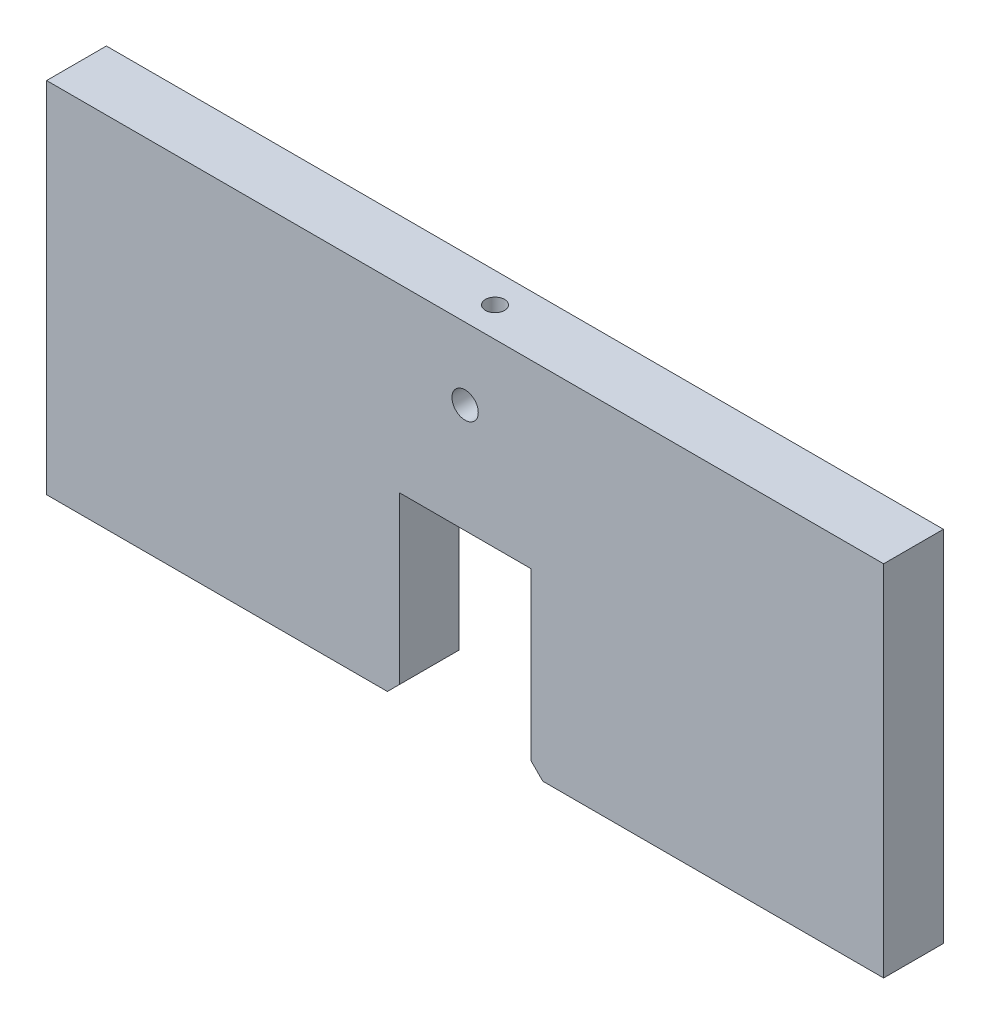
ISO-10303-21;
HEADER;
FILE_DESCRIPTION(('STEP AP214'),'2;1');
FILE_NAME('part.step','',(''),(''),'','','');
FILE_SCHEMA(('AUTOMOTIVE_DESIGN { 1 0 10303 214 1 1 1 1 }'));
ENDSEC;
DATA;
#1=APPLICATION_CONTEXT('core data for automotive mechanical design processes');
#2=APPLICATION_PROTOCOL_DEFINITION('international standard','automotive_design',2000,#1);
#3=PRODUCT_CONTEXT('',#1,'mechanical');
#4=PRODUCT('Part','Part','',(#3));
#5=PRODUCT_RELATED_PRODUCT_CATEGORY('part','',(#4));
#6=PRODUCT_DEFINITION_FORMATION('','',#4);
#7=PRODUCT_DEFINITION_CONTEXT('part definition',#1,'design');
#8=PRODUCT_DEFINITION('design','',#6,#7);
#9=PRODUCT_DEFINITION_SHAPE('','',#8);
#10=(LENGTH_UNIT() NAMED_UNIT(*) SI_UNIT(.MILLI.,.METRE.));
#11=(NAMED_UNIT(*) PLANE_ANGLE_UNIT() SI_UNIT($,.RADIAN.));
#12=(NAMED_UNIT(*) SI_UNIT($,.STERADIAN.) SOLID_ANGLE_UNIT());
#13=UNCERTAINTY_MEASURE_WITH_UNIT(LENGTH_MEASURE(1.E-05),#10,'distance_accuracy_value','');
#14=(GEOMETRIC_REPRESENTATION_CONTEXT(3) GLOBAL_UNCERTAINTY_ASSIGNED_CONTEXT((#13)) GLOBAL_UNIT_ASSIGNED_CONTEXT((#10,
#11,#12)) REPRESENTATION_CONTEXT('',''));
#15=CARTESIAN_POINT('',(0.,0.,0.));
#16=DIRECTION('',(0.,0.,1.));
#17=DIRECTION('',(1.,0.,0.));
#18=AXIS2_PLACEMENT_3D('',#15,#16,#17);
#19=CARTESIAN_POINT('',(-350.,232.421392473446,25.));
#20=DIRECTION('',(1.,0.,0.));
#21=DIRECTION('',(0.,1.,0.));
#22=AXIS2_PLACEMENT_3D('',#19,#20,#21);
#23=PLANE('',#22);
#24=DIRECTION('',(0.,-1.,0.));
#25=VECTOR('',#24,1.);
#26=CARTESIAN_POINT('',(-350.,232.421392473446,-25.));
#27=LINE('',#26,#25);
#28=CARTESIAN_POINT('',(-350.,232.421392473446,-25.));
#29=VERTEX_POINT('',#28);
#30=CARTESIAN_POINT('',(-350.,-67.5786075265541,-25.));
#31=VERTEX_POINT('',#30);
#32=EDGE_CURVE('E140',#29,#31,#27,.T.);
#33=ORIENTED_EDGE('',*,*,#32,.T.);
#34=DIRECTION('',(0.,0.,-1.));
#35=VECTOR('',#34,1.);
#36=CARTESIAN_POINT('',(-350.,-67.5786075265541,25.));
#37=LINE('',#36,#35);
#38=CARTESIAN_POINT('',(-350.,-67.5786075265541,25.));
#39=VERTEX_POINT('',#38);
#40=EDGE_CURVE('E11',#39,#31,#37,.T.);
#41=ORIENTED_EDGE('',*,*,#40,.F.);
#42=DIRECTION('',(0.,-1.,0.));
#43=VECTOR('',#42,1.);
#44=CARTESIAN_POINT('',(-350.,232.421392473446,25.));
#45=LINE('',#44,#43);
#46=CARTESIAN_POINT('',(-350.,232.421392473446,25.));
#47=VERTEX_POINT('',#46);
#48=EDGE_CURVE('E159',#47,#39,#45,.T.);
#49=ORIENTED_EDGE('',*,*,#48,.F.);
#50=DIRECTION('',(0.,0.,-1.));
#51=VECTOR('',#50,1.);
#52=CARTESIAN_POINT('',(-350.,232.421392473446,25.));
#53=LINE('',#52,#51);
#54=EDGE_CURVE('E136',#47,#29,#53,.T.);
#55=ORIENTED_EDGE('',*,*,#54,.T.);
#56=EDGE_LOOP('',(#33,#41,#49,#55));
#57=FACE_BOUND('',#56,.T.);
#58=ADVANCED_FACE('F32',(#57),#23,.F.);
#59=CARTESIAN_POINT('',(-350.,-67.5786075265541,25.));
#60=DIRECTION('',(0.,1.,0.));
#61=DIRECTION('',(-1.,0.,0.));
#62=AXIS2_PLACEMENT_3D('',#59,#60,#61);
#63=PLANE('',#62);
#64=CARTESIAN_POINT('',(-80.,-67.5786075265541,0.));
#65=DIRECTION('',(0.,-1.,0.));
#66=DIRECTION('',(1.,0.,0.));
#67=AXIS2_PLACEMENT_3D('',#64,#65,#66);
#68=CIRCLE('',#67,8.);
#69=CARTESIAN_POINT('',(-72.,-67.5786075265541,0.));
#70=VERTEX_POINT('',#69);
#71=EDGE_CURVE('E218',#70,#70,#68,.T.);
#72=ORIENTED_EDGE('',*,*,#71,.F.);
#73=EDGE_LOOP('',(#72));
#74=FACE_BOUND('',#73,.T.);
#75=DIRECTION('',(1.,0.,0.));
#76=VECTOR('',#75,1.);
#77=CARTESIAN_POINT('',(-350.,-67.5786075265541,-25.));
#78=LINE('',#77,#76);
#79=CARTESIAN_POINT('',(-65.,-67.5786075265541,-25.));
#80=VERTEX_POINT('',#79);
#81=EDGE_CURVE('E143',#31,#80,#78,.T.);
#82=ORIENTED_EDGE('',*,*,#81,.T.);
#83=DIRECTION('',(0.,0.,-1.));
#84=VECTOR('',#83,1.);
#85=CARTESIAN_POINT('',(-65.,-67.5786075265541,25.));
#86=LINE('',#85,#84);
#87=CARTESIAN_POINT('',(-65.,-67.5786075265541,25.));
#88=VERTEX_POINT('',#87);
#89=EDGE_CURVE('E40',#88,#80,#86,.T.);
#90=ORIENTED_EDGE('',*,*,#89,.F.);
#91=DIRECTION('',(1.,0.,0.));
#92=VECTOR('',#91,1.);
#93=CARTESIAN_POINT('',(-350.,-67.5786075265541,25.));
#94=LINE('',#93,#92);
#95=EDGE_CURVE('E97',#39,#88,#94,.T.);
#96=ORIENTED_EDGE('',*,*,#95,.F.);
#97=ORIENTED_EDGE('',*,*,#40,.T.);
#98=EDGE_LOOP('',(#82,#90,#96,#97));
#99=FACE_BOUND('',#98,.T.);
#100=ADVANCED_FACE('F252',(#74,#99),#63,.F.);
#101=CARTESIAN_POINT('',(-65.,-67.5786075265541,25.));
#102=DIRECTION('',(-0.707106781186546,0.707106781186549,0.));
#103=DIRECTION('',(-0.707106781186549,-0.707106781186546,0.));
#104=AXIS2_PLACEMENT_3D('',#101,#102,#103);
#105=PLANE('',#104);
#106=DIRECTION('',(0.707106781186549,0.707106781186546,0.));
#107=VECTOR('',#106,1.);
#108=CARTESIAN_POINT('',(-65.,-67.5786075265541,-25.));
#109=LINE('',#108,#107);
#110=CARTESIAN_POINT('',(-55.,-57.5786075265541,-25.));
#111=VERTEX_POINT('',#110);
#112=EDGE_CURVE('E146',#80,#111,#109,.T.);
#113=ORIENTED_EDGE('',*,*,#112,.T.);
#114=DIRECTION('',(0.,0.,-1.));
#115=VECTOR('',#114,1.);
#116=CARTESIAN_POINT('',(-55.,-57.5786075265541,25.));
#117=LINE('',#116,#115);
#118=CARTESIAN_POINT('',(-55.,-57.5786075265541,25.));
#119=VERTEX_POINT('',#118);
#120=EDGE_CURVE('E172',#119,#111,#117,.T.);
#121=ORIENTED_EDGE('',*,*,#120,.F.);
#122=DIRECTION('',(0.707106781186549,0.707106781186546,0.));
#123=VECTOR('',#122,1.);
#124=CARTESIAN_POINT('',(-65.,-67.5786075265541,25.));
#125=LINE('',#124,#123);
#126=EDGE_CURVE('E180',#88,#119,#125,.T.);
#127=ORIENTED_EDGE('',*,*,#126,.F.);
#128=ORIENTED_EDGE('',*,*,#89,.T.);
#129=EDGE_LOOP('',(#113,#121,#127,#128));
#130=FACE_BOUND('',#129,.T.);
#131=ADVANCED_FACE('F178',(#130),#105,.F.);
#132=CARTESIAN_POINT('',(-55.,-57.5786075265541,25.));
#133=DIRECTION('',(-1.,0.,0.));
#134=DIRECTION('',(0.,0.,1.));
#135=AXIS2_PLACEMENT_3D('',#132,#133,#134);
#136=PLANE('',#135);
#137=DIRECTION('',(0.,1.,0.));
#138=VECTOR('',#137,1.);
#139=CARTESIAN_POINT('',(-55.,-57.5786075265541,-25.));
#140=LINE('',#139,#138);
#141=CARTESIAN_POINT('',(-55.,81.4213924734459,-25.));
#142=VERTEX_POINT('',#141);
#143=EDGE_CURVE('E148',#111,#142,#140,.T.);
#144=ORIENTED_EDGE('',*,*,#143,.T.);
#145=DIRECTION('',(0.,0.,-1.));
#146=VECTOR('',#145,1.);
#147=CARTESIAN_POINT('',(-55.,81.4213924734459,25.));
#148=LINE('',#147,#146);
#149=CARTESIAN_POINT('',(-55.,81.4213924734459,25.));
#150=VERTEX_POINT('',#149);
#151=EDGE_CURVE('E169',#150,#142,#148,.T.);
#152=ORIENTED_EDGE('',*,*,#151,.F.);
#153=DIRECTION('',(0.,1.,0.));
#154=VECTOR('',#153,1.);
#155=CARTESIAN_POINT('',(-55.,-57.5786075265541,25.));
#156=LINE('',#155,#154);
#157=EDGE_CURVE('E198',#119,#150,#156,.T.);
#158=ORIENTED_EDGE('',*,*,#157,.F.);
#159=ORIENTED_EDGE('',*,*,#120,.T.);
#160=EDGE_LOOP('',(#144,#152,#158,#159));
#161=FACE_BOUND('',#160,.T.);
#162=ADVANCED_FACE('F189',(#161),#136,.F.);
#163=CARTESIAN_POINT('',(-55.,81.4213924734459,25.));
#164=DIRECTION('',(0.,1.,0.));
#165=DIRECTION('',(0.,0.,1.));
#166=AXIS2_PLACEMENT_3D('',#163,#164,#165);
#167=PLANE('',#166);
#168=DIRECTION('',(1.,0.,0.));
#169=VECTOR('',#168,1.);
#170=CARTESIAN_POINT('',(-55.,81.4213924734459,-25.));
#171=LINE('',#170,#169);
#172=CARTESIAN_POINT('',(55.,81.4213924734459,-25.));
#173=VERTEX_POINT('',#172);
#174=EDGE_CURVE('E150',#142,#173,#171,.T.);
#175=ORIENTED_EDGE('',*,*,#174,.T.);
#176=DIRECTION('',(0.,0.,-1.));
#177=VECTOR('',#176,1.);
#178=CARTESIAN_POINT('',(55.,81.4213924734459,25.));
#179=LINE('',#178,#177);
#180=CARTESIAN_POINT('',(55.,81.4213924734459,25.));
#181=VERTEX_POINT('',#180);
#182=EDGE_CURVE('E166',#181,#173,#179,.T.);
#183=ORIENTED_EDGE('',*,*,#182,.F.);
#184=DIRECTION('',(1.,0.,0.));
#185=VECTOR('',#184,1.);
#186=CARTESIAN_POINT('',(-55.,81.4213924734459,25.));
#187=LINE('',#186,#185);
#188=EDGE_CURVE('E195',#150,#181,#187,.T.);
#189=ORIENTED_EDGE('',*,*,#188,.F.);
#190=ORIENTED_EDGE('',*,*,#151,.T.);
#191=EDGE_LOOP('',(#175,#183,#189,#190));
#192=FACE_BOUND('',#191,.T.);
#193=ADVANCED_FACE('F193',(#192),#167,.F.);
#194=CARTESIAN_POINT('',(55.,-57.5786075265541,25.));
#195=DIRECTION('',(1.,0.,0.));
#196=DIRECTION('',(0.,1.,0.));
#197=AXIS2_PLACEMENT_3D('',#194,#195,#196);
#198=PLANE('',#197);
#199=DIRECTION('',(0.,-1.,0.));
#200=VECTOR('',#199,1.);
#201=CARTESIAN_POINT('',(55.,-57.5786075265541,-25.));
#202=LINE('',#201,#200);
#203=CARTESIAN_POINT('',(55.,-57.5786075265541,-25.));
#204=VERTEX_POINT('',#203);
#205=EDGE_CURVE('E152',#173,#204,#202,.T.);
#206=ORIENTED_EDGE('',*,*,#205,.T.);
#207=DIRECTION('',(0.,0.,-1.));
#208=VECTOR('',#207,1.);
#209=CARTESIAN_POINT('',(55.,-57.5786075265541,25.));
#210=LINE('',#209,#208);
#211=CARTESIAN_POINT('',(55.,-57.5786075265541,25.));
#212=VERTEX_POINT('',#211);
#213=EDGE_CURVE('E163',#212,#204,#210,.T.);
#214=ORIENTED_EDGE('',*,*,#213,.F.);
#215=DIRECTION('',(0.,-1.,0.));
#216=VECTOR('',#215,1.);
#217=CARTESIAN_POINT('',(55.,-57.5786075265541,25.));
#218=LINE('',#217,#216);
#219=EDGE_CURVE('E197',#181,#212,#218,.T.);
#220=ORIENTED_EDGE('',*,*,#219,.F.);
#221=ORIENTED_EDGE('',*,*,#182,.T.);
#222=EDGE_LOOP('',(#206,#214,#220,#221));
#223=FACE_BOUND('',#222,.T.);
#224=ADVANCED_FACE('F248',(#223),#198,.F.);
#225=CARTESIAN_POINT('',(65.,-67.5786075265541,25.));
#226=DIRECTION('',(0.707106781186546,0.707106781186549,0.));
#227=DIRECTION('',(-0.707106781186549,0.707106781186546,0.));
#228=AXIS2_PLACEMENT_3D('',#225,#226,#227);
#229=PLANE('',#228);
#230=DIRECTION('',(0.707106781186549,-0.707106781186546,0.));
#231=VECTOR('',#230,1.);
#232=CARTESIAN_POINT('',(65.,-67.5786075265541,-25.));
#233=LINE('',#232,#231);
#234=CARTESIAN_POINT('',(65.,-67.5786075265541,-25.));
#235=VERTEX_POINT('',#234);
#236=EDGE_CURVE('E154',#204,#235,#233,.T.);
#237=ORIENTED_EDGE('',*,*,#236,.T.);
#238=DIRECTION('',(0.,0.,-1.));
#239=VECTOR('',#238,1.);
#240=CARTESIAN_POINT('',(65.,-67.5786075265541,25.));
#241=LINE('',#240,#239);
#242=CARTESIAN_POINT('',(65.,-67.5786075265541,25.));
#243=VERTEX_POINT('',#242);
#244=EDGE_CURVE('E131',#243,#235,#241,.T.);
#245=ORIENTED_EDGE('',*,*,#244,.F.);
#246=DIRECTION('',(0.707106781186549,-0.707106781186546,0.));
#247=VECTOR('',#246,1.);
#248=CARTESIAN_POINT('',(65.,-67.5786075265541,25.));
#249=LINE('',#248,#247);
#250=EDGE_CURVE('E122',#212,#243,#249,.T.);
#251=ORIENTED_EDGE('',*,*,#250,.F.);
#252=ORIENTED_EDGE('',*,*,#213,.T.);
#253=EDGE_LOOP('',(#237,#245,#251,#252));
#254=FACE_BOUND('',#253,.T.);
#255=ADVANCED_FACE('F240',(#254),#229,.F.);
#256=CARTESIAN_POINT('',(350.,-67.5786075265541,25.));
#257=DIRECTION('',(0.,1.,0.));
#258=DIRECTION('',(0.,0.,1.));
#259=AXIS2_PLACEMENT_3D('',#256,#257,#258);
#260=PLANE('',#259);
#261=CARTESIAN_POINT('',(80.,-67.578607526554,0.));
#262=DIRECTION('',(0.,-1.,0.));
#263=DIRECTION('',(1.,0.,0.));
#264=AXIS2_PLACEMENT_3D('',#261,#262,#263);
#265=CIRCLE('',#264,8.);
#266=CARTESIAN_POINT('',(88.,-67.578607526554,0.));
#267=VERTEX_POINT('',#266);
#268=EDGE_CURVE('E224',#267,#267,#265,.T.);
#269=ORIENTED_EDGE('',*,*,#268,.F.);
#270=EDGE_LOOP('',(#269));
#271=FACE_BOUND('',#270,.T.);
#272=DIRECTION('',(1.,0.,0.));
#273=VECTOR('',#272,1.);
#274=CARTESIAN_POINT('',(350.,-67.5786075265541,-25.));
#275=LINE('',#274,#273);
#276=CARTESIAN_POINT('',(350.,-67.5786075265541,-25.));
#277=VERTEX_POINT('',#276);
#278=EDGE_CURVE('E130',#235,#277,#275,.T.);
#279=ORIENTED_EDGE('',*,*,#278,.T.);
#280=DIRECTION('',(0.,0.,-1.));
#281=VECTOR('',#280,1.);
#282=CARTESIAN_POINT('',(350.,-67.5786075265541,25.));
#283=LINE('',#282,#281);
#284=CARTESIAN_POINT('',(350.,-67.5786075265541,25.));
#285=VERTEX_POINT('',#284);
#286=EDGE_CURVE('E127',#285,#277,#283,.T.);
#287=ORIENTED_EDGE('',*,*,#286,.F.);
#288=DIRECTION('',(1.,0.,0.));
#289=VECTOR('',#288,1.);
#290=CARTESIAN_POINT('',(350.,-67.5786075265541,25.));
#291=LINE('',#290,#289);
#292=EDGE_CURVE('E116',#243,#285,#291,.T.);
#293=ORIENTED_EDGE('',*,*,#292,.F.);
#294=ORIENTED_EDGE('',*,*,#244,.T.);
#295=EDGE_LOOP('',(#279,#287,#293,#294));
#296=FACE_BOUND('',#295,.T.);
#297=ADVANCED_FACE('F128',(#271,#296),#260,.F.);
#298=CARTESIAN_POINT('',(350.,232.421392473446,25.));
#299=DIRECTION('',(-1.,0.,0.));
#300=DIRECTION('',(0.,-1.,0.));
#301=AXIS2_PLACEMENT_3D('',#298,#299,#300);
#302=PLANE('',#301);
#303=DIRECTION('',(0.,1.,0.));
#304=VECTOR('',#303,1.);
#305=CARTESIAN_POINT('',(350.,232.421392473446,-25.));
#306=LINE('',#305,#304);
#307=CARTESIAN_POINT('',(350.,232.421392473446,-25.));
#308=VERTEX_POINT('',#307);
#309=EDGE_CURVE('E83',#277,#308,#306,.T.);
#310=ORIENTED_EDGE('',*,*,#309,.T.);
#311=DIRECTION('',(0.,0.,-1.));
#312=VECTOR('',#311,1.);
#313=CARTESIAN_POINT('',(350.,232.421392473446,25.));
#314=LINE('',#313,#312);
#315=CARTESIAN_POINT('',(350.,232.421392473446,25.));
#316=VERTEX_POINT('',#315);
#317=EDGE_CURVE('E132',#316,#308,#314,.T.);
#318=ORIENTED_EDGE('',*,*,#317,.F.);
#319=DIRECTION('',(0.,1.,0.));
#320=VECTOR('',#319,1.);
#321=CARTESIAN_POINT('',(350.,232.421392473446,25.));
#322=LINE('',#321,#320);
#323=EDGE_CURVE('E120',#285,#316,#322,.T.);
#324=ORIENTED_EDGE('',*,*,#323,.F.);
#325=ORIENTED_EDGE('',*,*,#286,.T.);
#326=EDGE_LOOP('',(#310,#318,#324,#325));
#327=FACE_BOUND('',#326,.T.);
#328=ADVANCED_FACE('F134',(#327),#302,.F.);
#329=CARTESIAN_POINT('',(350.,232.421392473446,25.));
#330=DIRECTION('',(0.,-1.,0.));
#331=DIRECTION('',(0.,0.,-1.));
#332=AXIS2_PLACEMENT_3D('',#329,#330,#331);
#333=PLANE('',#332);
#334=CARTESIAN_POINT('',(0.,232.421392473446,0.));
#335=DIRECTION('',(0.,1.,0.));
#336=DIRECTION('',(0.,0.,1.));
#337=AXIS2_PLACEMENT_3D('',#334,#335,#336);
#338=CIRCLE('',#337,8.);
#339=CARTESIAN_POINT('',(0.,232.421392473446,8.));
#340=VERTEX_POINT('',#339);
#341=EDGE_CURVE('E212',#340,#340,#338,.T.);
#342=ORIENTED_EDGE('',*,*,#341,.F.);
#343=EDGE_LOOP('',(#342));
#344=FACE_BOUND('',#343,.T.);
#345=DIRECTION('',(-1.,0.,0.));
#346=VECTOR('',#345,1.);
#347=CARTESIAN_POINT('',(350.,232.421392473446,-25.));
#348=LINE('',#347,#346);
#349=EDGE_CURVE('E89',#308,#29,#348,.T.);
#350=ORIENTED_EDGE('',*,*,#349,.T.);
#351=ORIENTED_EDGE('',*,*,#54,.F.);
#352=DIRECTION('',(-1.,0.,0.));
#353=VECTOR('',#352,1.);
#354=CARTESIAN_POINT('',(350.,232.421392473446,25.));
#355=LINE('',#354,#353);
#356=EDGE_CURVE('E48',#316,#47,#355,.T.);
#357=ORIENTED_EDGE('',*,*,#356,.F.);
#358=ORIENTED_EDGE('',*,*,#317,.T.);
#359=EDGE_LOOP('',(#350,#351,#357,#358));
#360=FACE_BOUND('',#359,.T.);
#361=ADVANCED_FACE('F246',(#344,#360),#333,.F.);
#362=CARTESIAN_POINT('',(0.,0.,25.));
#363=DIRECTION('',(0.,0.,1.));
#364=DIRECTION('',(1.,0.,0.));
#365=AXIS2_PLACEMENT_3D('',#362,#363,#364);
#366=PLANE('',#365);
#367=CARTESIAN_POINT('',(0.,172.421392473446,25.));
#368=DIRECTION('',(0.,0.,1.));
#369=DIRECTION('',(1.,0.,0.));
#370=AXIS2_PLACEMENT_3D('',#367,#368,#369);
#371=CIRCLE('',#370,11.);
#372=CARTESIAN_POINT('',(11.,172.421392473446,25.));
#373=VERTEX_POINT('',#372);
#374=EDGE_CURVE('E208',#373,#373,#371,.T.);
#375=ORIENTED_EDGE('',*,*,#374,.F.);
#376=EDGE_LOOP('',(#375));
#377=FACE_BOUND('',#376,.T.);
#378=ORIENTED_EDGE('',*,*,#48,.T.);
#379=ORIENTED_EDGE('',*,*,#95,.T.);
#380=ORIENTED_EDGE('',*,*,#126,.T.);
#381=ORIENTED_EDGE('',*,*,#157,.T.);
#382=ORIENTED_EDGE('',*,*,#188,.T.);
#383=ORIENTED_EDGE('',*,*,#219,.T.);
#384=ORIENTED_EDGE('',*,*,#250,.T.);
#385=ORIENTED_EDGE('',*,*,#292,.T.);
#386=ORIENTED_EDGE('',*,*,#323,.T.);
#387=ORIENTED_EDGE('',*,*,#356,.T.);
#388=EDGE_LOOP('',(#378,#379,#380,#381,#382,#383,#384,#385,#386,#387));
#389=FACE_BOUND('',#388,.T.);
#390=ADVANCED_FACE('F118',(#377,#389),#366,.T.);
#391=CARTESIAN_POINT('',(0.,0.,-25.));
#392=DIRECTION('',(0.,0.,1.));
#393=DIRECTION('',(1.,0.,0.));
#394=AXIS2_PLACEMENT_3D('',#391,#392,#393);
#395=PLANE('',#394);
#396=CARTESIAN_POINT('',(0.,172.421392473446,-25.));
#397=DIRECTION('',(0.,0.,1.));
#398=DIRECTION('',(1.,0.,0.));
#399=AXIS2_PLACEMENT_3D('',#396,#397,#398);
#400=CIRCLE('',#399,11.);
#401=CARTESIAN_POINT('',(11.,172.421392473446,-25.));
#402=VERTEX_POINT('',#401);
#403=EDGE_CURVE('E144',#402,#402,#400,.T.);
#404=ORIENTED_EDGE('',*,*,#403,.T.);
#405=EDGE_LOOP('',(#404));
#406=FACE_BOUND('',#405,.T.);
#407=ORIENTED_EDGE('',*,*,#32,.F.);
#408=ORIENTED_EDGE('',*,*,#349,.F.);
#409=ORIENTED_EDGE('',*,*,#309,.F.);
#410=ORIENTED_EDGE('',*,*,#278,.F.);
#411=ORIENTED_EDGE('',*,*,#236,.F.);
#412=ORIENTED_EDGE('',*,*,#205,.F.);
#413=ORIENTED_EDGE('',*,*,#174,.F.);
#414=ORIENTED_EDGE('',*,*,#143,.F.);
#415=ORIENTED_EDGE('',*,*,#112,.F.);
#416=ORIENTED_EDGE('',*,*,#81,.F.);
#417=EDGE_LOOP('',(#407,#408,#409,#410,#411,#412,#413,#414,#415,#416));
#418=FACE_BOUND('',#417,.T.);
#419=ADVANCED_FACE('F184',(#406,#418),#395,.F.);
#420=CARTESIAN_POINT('',(0.,172.421392473446,-25.));
#421=DIRECTION('',(0.,0.,1.));
#422=DIRECTION('',(1.,0.,0.));
#423=AXIS2_PLACEMENT_3D('',#420,#421,#422);
#424=CYLINDRICAL_SURFACE('',#423,11.);
#425=ORIENTED_EDGE('',*,*,#403,.F.);
#426=EDGE_LOOP('',(#425));
#427=FACE_BOUND('',#426,.T.);
#428=ORIENTED_EDGE('',*,*,#374,.T.);
#429=EDGE_LOOP('',(#428));
#430=FACE_BOUND('',#429,.T.);
#431=ADVANCED_FACE('F322',(#427,#430),#424,.F.);
#432=CARTESIAN_POINT('',(0.,197.421392473446,0.));
#433=DIRECTION('',(0.,1.,0.));
#434=DIRECTION('',(0.,0.,1.));
#435=AXIS2_PLACEMENT_3D('',#432,#433,#434);
#436=CYLINDRICAL_SURFACE('',#435,8.);
#437=CARTESIAN_POINT('',(0.,197.421392473446,0.));
#438=DIRECTION('',(0.,1.,0.));
#439=DIRECTION('',(0.,0.,1.));
#440=AXIS2_PLACEMENT_3D('',#437,#438,#439);
#441=CIRCLE('',#440,8.);
#442=CARTESIAN_POINT('',(0.,197.421392473446,8.));
#443=VERTEX_POINT('',#442);
#444=EDGE_CURVE('E211',#443,#443,#441,.T.);
#445=ORIENTED_EDGE('',*,*,#444,.F.);
#446=EDGE_LOOP('',(#445));
#447=FACE_BOUND('',#446,.T.);
#448=ORIENTED_EDGE('',*,*,#341,.T.);
#449=EDGE_LOOP('',(#448));
#450=FACE_BOUND('',#449,.T.);
#451=ADVANCED_FACE('F332',(#447,#450),#436,.F.);
#452=CARTESIAN_POINT('',(0.,197.421392473446,0.));
#453=DIRECTION('',(0.,1.,0.));
#454=DIRECTION('',(0.,0.,1.));
#455=AXIS2_PLACEMENT_3D('',#452,#453,#454);
#456=PLANE('',#455);
#457=ORIENTED_EDGE('',*,*,#444,.T.);
#458=EDGE_LOOP('',(#457));
#459=FACE_BOUND('',#458,.T.);
#460=ADVANCED_FACE('F349',(#459),#456,.T.);
#461=CARTESIAN_POINT('',(-80.,-37.5786075265541,0.));
#462=DIRECTION('',(0.,-1.,0.));
#463=DIRECTION('',(1.,0.,0.));
#464=AXIS2_PLACEMENT_3D('',#461,#462,#463);
#465=CYLINDRICAL_SURFACE('',#464,8.);
#466=CARTESIAN_POINT('',(-80.,-37.5786075265541,0.));
#467=DIRECTION('',(0.,-1.,0.));
#468=DIRECTION('',(1.,0.,0.));
#469=AXIS2_PLACEMENT_3D('',#466,#467,#468);
#470=CIRCLE('',#469,8.);
#471=CARTESIAN_POINT('',(-72.,-37.5786075265541,0.));
#472=VERTEX_POINT('',#471);
#473=EDGE_CURVE('E215',#472,#472,#470,.T.);
#474=ORIENTED_EDGE('',*,*,#473,.F.);
#475=EDGE_LOOP('',(#474));
#476=FACE_BOUND('',#475,.T.);
#477=ORIENTED_EDGE('',*,*,#71,.T.);
#478=EDGE_LOOP('',(#477));
#479=FACE_BOUND('',#478,.T.);
#480=ADVANCED_FACE('F358',(#476,#479),#465,.F.);
#481=CARTESIAN_POINT('',(-80.,-37.5786075265541,0.));
#482=DIRECTION('',(0.,-1.,0.));
#483=DIRECTION('',(1.,0.,0.));
#484=AXIS2_PLACEMENT_3D('',#481,#482,#483);
#485=PLANE('',#484);
#486=ORIENTED_EDGE('',*,*,#473,.T.);
#487=EDGE_LOOP('',(#486));
#488=FACE_BOUND('',#487,.T.);
#489=ADVANCED_FACE('F235',(#488),#485,.T.);
#490=CARTESIAN_POINT('',(80.,-37.578607526554,0.));
#491=DIRECTION('',(0.,-1.,0.));
#492=DIRECTION('',(1.,0.,0.));
#493=AXIS2_PLACEMENT_3D('',#490,#491,#492);
#494=CYLINDRICAL_SURFACE('',#493,8.);
#495=CARTESIAN_POINT('',(80.,-37.578607526554,0.));
#496=DIRECTION('',(0.,-1.,0.));
#497=DIRECTION('',(1.,0.,0.));
#498=AXIS2_PLACEMENT_3D('',#495,#496,#497);
#499=CIRCLE('',#498,8.);
#500=CARTESIAN_POINT('',(88.,-37.578607526554,0.));
#501=VERTEX_POINT('',#500);
#502=EDGE_CURVE('E221',#501,#501,#499,.T.);
#503=ORIENTED_EDGE('',*,*,#502,.F.);
#504=EDGE_LOOP('',(#503));
#505=FACE_BOUND('',#504,.T.);
#506=ORIENTED_EDGE('',*,*,#268,.T.);
#507=EDGE_LOOP('',(#506));
#508=FACE_BOUND('',#507,.T.);
#509=ADVANCED_FACE('F232',(#505,#508),#494,.F.);
#510=CARTESIAN_POINT('',(80.,-37.578607526554,0.));
#511=DIRECTION('',(0.,-1.,0.));
#512=DIRECTION('',(1.,0.,0.));
#513=AXIS2_PLACEMENT_3D('',#510,#511,#512);
#514=PLANE('',#513);
#515=ORIENTED_EDGE('',*,*,#502,.T.);
#516=EDGE_LOOP('',(#515));
#517=FACE_BOUND('',#516,.T.);
#518=ADVANCED_FACE('F230',(#517),#514,.T.);
#519=CLOSED_SHELL('',(#58,#100,#131,#162,#193,#224,#255,#297,#328,#361,#390,#419,#431,#451,#460,
#480,#489,#509,#518));
#520=MANIFOLD_SOLID_BREP('B2',#519);
#521=ADVANCED_BREP_SHAPE_REPRESENTATION('',(#18,#520),#14);
#522=SHAPE_DEFINITION_REPRESENTATION(#9,#521);
ENDSEC;
END-ISO-10303-21;
